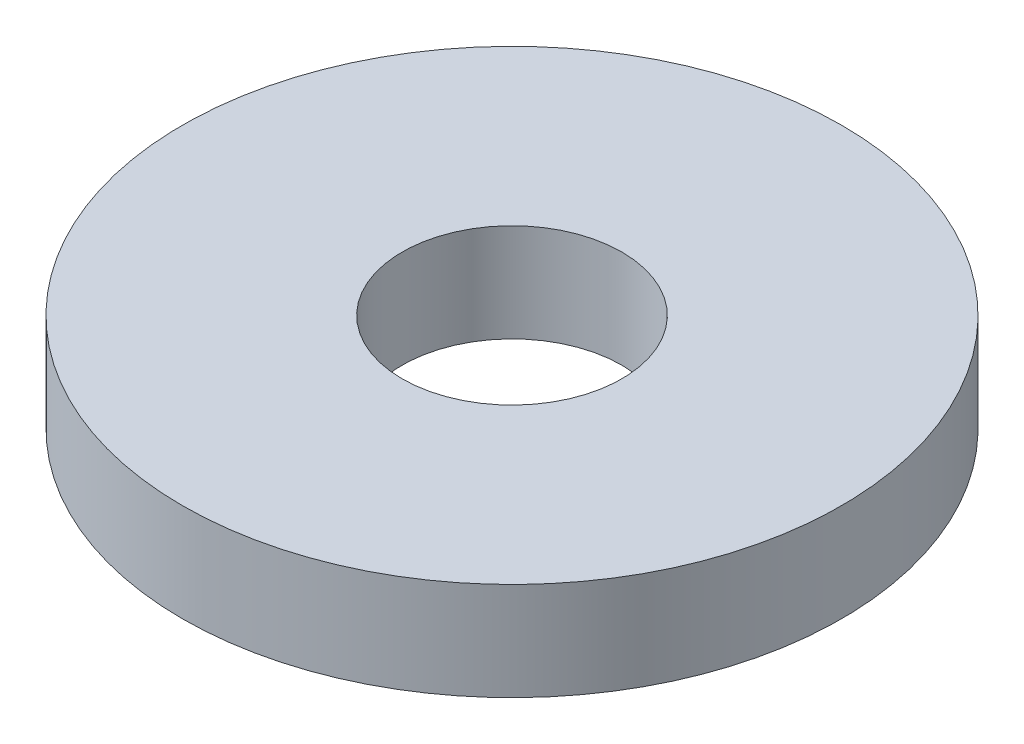
ISO-10303-21;
HEADER;
FILE_DESCRIPTION(('STEP AP214'),'2;1');
FILE_NAME('part.step','',(''),(''),'','','');
FILE_SCHEMA(('AUTOMOTIVE_DESIGN { 1 0 10303 214 1 1 1 1 }'));
ENDSEC;
DATA;
#1=APPLICATION_CONTEXT('core data for automotive mechanical design processes');
#2=APPLICATION_PROTOCOL_DEFINITION('international standard','automotive_design',2000,#1);
#3=PRODUCT_CONTEXT('',#1,'mechanical');
#4=PRODUCT('Part','Part','',(#3));
#5=PRODUCT_RELATED_PRODUCT_CATEGORY('part','',(#4));
#6=PRODUCT_DEFINITION_FORMATION('','',#4);
#7=PRODUCT_DEFINITION_CONTEXT('part definition',#1,'design');
#8=PRODUCT_DEFINITION('design','',#6,#7);
#9=PRODUCT_DEFINITION_SHAPE('','',#8);
#10=(LENGTH_UNIT() NAMED_UNIT(*) SI_UNIT(.MILLI.,.METRE.));
#11=(NAMED_UNIT(*) PLANE_ANGLE_UNIT() SI_UNIT($,.RADIAN.));
#12=(NAMED_UNIT(*) SI_UNIT($,.STERADIAN.) SOLID_ANGLE_UNIT());
#13=UNCERTAINTY_MEASURE_WITH_UNIT(LENGTH_MEASURE(1.E-05),#10,'distance_accuracy_value','');
#14=(GEOMETRIC_REPRESENTATION_CONTEXT(3) GLOBAL_UNCERTAINTY_ASSIGNED_CONTEXT((#13)) GLOBAL_UNIT_ASSIGNED_CONTEXT((#10,
#11,#12)) REPRESENTATION_CONTEXT('',''));
#15=CARTESIAN_POINT('',(0.,0.,0.));
#16=DIRECTION('',(0.,0.,1.));
#17=DIRECTION('',(1.,0.,0.));
#18=AXIS2_PLACEMENT_3D('',#15,#16,#17);
#19=CARTESIAN_POINT('',(0.,29.,0.));
#20=DIRECTION('',(0.,-1.,0.));
#21=DIRECTION('',(0.,0.,-1.));
#22=AXIS2_PLACEMENT_3D('',#19,#20,#21);
#23=CYLINDRICAL_SURFACE('',#22,97.5);
#24=CARTESIAN_POINT('',(0.,29.,0.));
#25=DIRECTION('',(0.,1.,0.));
#26=DIRECTION('',(0.,0.,1.));
#27=AXIS2_PLACEMENT_3D('',#24,#25,#26);
#28=CIRCLE('',#27,97.5);
#29=CARTESIAN_POINT('',(0.,29.,-97.5));
#30=VERTEX_POINT('',#29);
#31=EDGE_CURVE('E10',#30,#30,#28,.T.);
#32=CARTESIAN_POINT('',(0.,0.,0.));
#33=DIRECTION('',(0.,1.,0.));
#34=DIRECTION('',(0.,0.,1.));
#35=AXIS2_PLACEMENT_3D('',#32,#33,#34);
#36=CIRCLE('',#35,97.5);
#37=CARTESIAN_POINT('',(0.,0.,-97.5));
#38=VERTEX_POINT('',#37);
#39=EDGE_CURVE('E37',#38,#38,#36,.T.);
#40=CARTESIAN_POINT('',(0.,29.,-97.5));
#41=CARTESIAN_POINT('',(0.,28.6979166666667,-97.5));
#42=CARTESIAN_POINT('',(0.,28.3958333333333,-97.5));
#43=CARTESIAN_POINT('',(0.,27.7916666666667,-97.5));
#44=CARTESIAN_POINT('',(0.,27.4895833333333,-97.5));
#45=CARTESIAN_POINT('',(0.,26.8854166666667,-97.5));
#46=CARTESIAN_POINT('',(0.,26.5833333333333,-97.5));
#47=CARTESIAN_POINT('',(0.,25.9791666666667,-97.5));
#48=CARTESIAN_POINT('',(0.,25.6770833333333,-97.5));
#49=CARTESIAN_POINT('',(0.,25.0729166666667,-97.5));
#50=CARTESIAN_POINT('',(0.,24.7708333333333,-97.5));
#51=CARTESIAN_POINT('',(0.,24.1666666666667,-97.5));
#52=CARTESIAN_POINT('',(0.,23.8645833333333,-97.5));
#53=CARTESIAN_POINT('',(0.,23.2604166666667,-97.5));
#54=CARTESIAN_POINT('',(0.,22.9583333333333,-97.5));
#55=CARTESIAN_POINT('',(0.,22.3541666666667,-97.5));
#56=CARTESIAN_POINT('',(0.,22.0520833333333,-97.5));
#57=CARTESIAN_POINT('',(0.,21.4479166666667,-97.5));
#58=CARTESIAN_POINT('',(0.,21.1458333333333,-97.5));
#59=CARTESIAN_POINT('',(0.,20.5416666666667,-97.5));
#60=CARTESIAN_POINT('',(0.,20.2395833333333,-97.5));
#61=CARTESIAN_POINT('',(0.,19.6354166666667,-97.5));
#62=CARTESIAN_POINT('',(0.,19.3333333333333,-97.5));
#63=CARTESIAN_POINT('',(0.,18.7291666666667,-97.5));
#64=CARTESIAN_POINT('',(0.,18.4270833333333,-97.5));
#65=CARTESIAN_POINT('',(0.,17.8229166666667,-97.5));
#66=CARTESIAN_POINT('',(0.,17.5208333333333,-97.5));
#67=CARTESIAN_POINT('',(0.,16.9166666666667,-97.5));
#68=CARTESIAN_POINT('',(0.,16.6145833333333,-97.5));
#69=CARTESIAN_POINT('',(0.,16.0104166666667,-97.5));
#70=CARTESIAN_POINT('',(0.,15.7083333333333,-97.5));
#71=CARTESIAN_POINT('',(0.,15.1041666666667,-97.5));
#72=CARTESIAN_POINT('',(0.,14.8020833333333,-97.5));
#73=CARTESIAN_POINT('',(0.,14.1979166666667,-97.5));
#74=CARTESIAN_POINT('',(0.,13.8958333333333,-97.5));
#75=CARTESIAN_POINT('',(0.,13.2916666666667,-97.5));
#76=CARTESIAN_POINT('',(0.,12.9895833333333,-97.5));
#77=CARTESIAN_POINT('',(0.,12.3854166666667,-97.5));
#78=CARTESIAN_POINT('',(0.,12.0833333333333,-97.5));
#79=CARTESIAN_POINT('',(0.,11.4791666666667,-97.5));
#80=CARTESIAN_POINT('',(0.,11.1770833333333,-97.5));
#81=CARTESIAN_POINT('',(0.,10.5729166666667,-97.5));
#82=CARTESIAN_POINT('',(0.,10.2708333333333,-97.5));
#83=CARTESIAN_POINT('',(0.,9.66666666666667,-97.5));
#84=CARTESIAN_POINT('',(0.,9.36458333333333,-97.5));
#85=CARTESIAN_POINT('',(0.,8.76041666666667,-97.5));
#86=CARTESIAN_POINT('',(0.,8.45833333333333,-97.5));
#87=CARTESIAN_POINT('',(0.,7.85416666666667,-97.5));
#88=CARTESIAN_POINT('',(0.,7.55208333333333,-97.5));
#89=CARTESIAN_POINT('',(0.,6.94791666666667,-97.5));
#90=CARTESIAN_POINT('',(0.,6.64583333333333,-97.5));
#91=CARTESIAN_POINT('',(0.,6.04166666666667,-97.5));
#92=CARTESIAN_POINT('',(0.,5.73958333333333,-97.5));
#93=CARTESIAN_POINT('',(0.,5.13541666666667,-97.5));
#94=CARTESIAN_POINT('',(0.,4.83333333333333,-97.5));
#95=CARTESIAN_POINT('',(0.,4.22916666666667,-97.5));
#96=CARTESIAN_POINT('',(0.,3.92708333333333,-97.5));
#97=CARTESIAN_POINT('',(0.,3.32291666666667,-97.5));
#98=CARTESIAN_POINT('',(0.,3.02083333333333,-97.5));
#99=CARTESIAN_POINT('',(0.,2.41666666666667,-97.5));
#100=CARTESIAN_POINT('',(0.,2.11458333333333,-97.5));
#101=CARTESIAN_POINT('',(0.,1.51041666666667,-97.5));
#102=CARTESIAN_POINT('',(0.,1.20833333333333,-97.5));
#103=CARTESIAN_POINT('',(0.,0.604166666666667,-97.5));
#104=CARTESIAN_POINT('',(0.,0.302083333333333,-97.5));
#105=CARTESIAN_POINT('',(0.,0.,-97.5));
#106=B_SPLINE_CURVE_WITH_KNOTS('',3,(#40,#41,#42,#43,#44,#45,#46,#47,#48,#49,#50,#51,#52,#53,
#54,#55,#56,#57,#58,#59,#60,#61,#62,#63,#64,#65,#66,#67,#68,#69,#70,#71,#72,#73,#74,#75,#76,#77,
#78,#79,#80,#81,#82,#83,#84,#85,#86,#87,#88,#89,#90,#91,#92,#93,#94,#95,#96,#97,#98,#99,#100,
#101,#102,#103,#104,#105),.UNSPECIFIED.,.F.,.F.,(4,2,2,2,2,2,2,2,2,2,2,2,2,2,2,2,2,2,2,2,2,2,2,
2,2,2,2,2,2,2,2,2,4),(0.,0.906249999999997,1.8125,2.71875,3.625,4.53125,5.4375,6.34375,7.25,
8.15625,9.0625,9.96875,10.875,11.78125,12.6875,13.59375,14.5,15.40625,16.3125,17.21875,18.125,
19.03125,19.9375,20.84375,21.75,22.65625,23.5625,24.46875,25.375,26.28125,27.1875,28.09375,29.),.UNSPECIFIED.);
#107=EDGE_CURVE('BSEAM40',#30,#38,#106,.T.);
#108=ORIENTED_EDGE('',*,*,#31,.F.);
#109=ORIENTED_EDGE('',*,*,#39,.T.);
#110=ORIENTED_EDGE('',*,*,#107,.T.);
#111=ORIENTED_EDGE('',*,*,#107,.F.);
#112=EDGE_LOOP('',(#108,#110,#109,#111));
#113=FACE_BOUND('',#112,.T.);
#114=ADVANCED_FACE('F40',(#113),#23,.T.);
#115=CARTESIAN_POINT('',(0.,29.,0.));
#116=DIRECTION('',(0.,1.,0.));
#117=DIRECTION('',(0.,0.,1.));
#118=AXIS2_PLACEMENT_3D('',#115,#116,#117);
#119=PLANE('',#118);
#120=CARTESIAN_POINT('',(0.,29.,0.));
#121=DIRECTION('',(0.,1.,0.));
#122=DIRECTION('',(0.,0.,1.));
#123=AXIS2_PLACEMENT_3D('',#120,#121,#122);
#124=CIRCLE('',#123,32.5);
#125=CARTESIAN_POINT('',(0.,29.,-32.5));
#126=VERTEX_POINT('',#125);
#127=EDGE_CURVE('E50',#126,#126,#124,.T.);
#128=ORIENTED_EDGE('',*,*,#127,.F.);
#129=EDGE_LOOP('',(#128));
#130=FACE_BOUND('',#129,.T.);
#131=ORIENTED_EDGE('',*,*,#31,.T.);
#132=EDGE_LOOP('',(#131));
#133=FACE_BOUND('',#132,.T.);
#134=ADVANCED_FACE('F59',(#130,#133),#119,.T.);
#135=CARTESIAN_POINT('',(0.,0.,0.));
#136=DIRECTION('',(0.,1.,0.));
#137=DIRECTION('',(0.,0.,1.));
#138=AXIS2_PLACEMENT_3D('',#135,#136,#137);
#139=PLANE('',#138);
#140=CARTESIAN_POINT('',(0.,0.,0.));
#141=DIRECTION('',(0.,1.,0.));
#142=DIRECTION('',(0.,0.,1.));
#143=AXIS2_PLACEMENT_3D('',#140,#141,#142);
#144=CIRCLE('',#143,32.5);
#145=CARTESIAN_POINT('',(0.,0.,-32.5));
#146=VERTEX_POINT('',#145);
#147=EDGE_CURVE('E47',#146,#146,#144,.T.);
#148=ORIENTED_EDGE('',*,*,#147,.T.);
#149=EDGE_LOOP('',(#148));
#150=FACE_BOUND('',#149,.T.);
#151=ORIENTED_EDGE('',*,*,#39,.F.);
#152=EDGE_LOOP('',(#151));
#153=FACE_BOUND('',#152,.T.);
#154=ADVANCED_FACE('F58',(#150,#153),#139,.F.);
#155=CARTESIAN_POINT('',(0.,29.,0.));
#156=DIRECTION('',(0.,-1.,0.));
#157=DIRECTION('',(0.,0.,-1.));
#158=AXIS2_PLACEMENT_3D('',#155,#156,#157);
#159=CYLINDRICAL_SURFACE('',#158,32.5);
#160=CARTESIAN_POINT('',(0.,29.,-32.5));
#161=CARTESIAN_POINT('',(0.,28.6979166666667,-32.5));
#162=CARTESIAN_POINT('',(0.,28.3958333333333,-32.5));
#163=CARTESIAN_POINT('',(0.,27.7916666666667,-32.5));
#164=CARTESIAN_POINT('',(0.,27.4895833333333,-32.5));
#165=CARTESIAN_POINT('',(0.,26.8854166666667,-32.5));
#166=CARTESIAN_POINT('',(0.,26.5833333333333,-32.5));
#167=CARTESIAN_POINT('',(0.,25.9791666666667,-32.5));
#168=CARTESIAN_POINT('',(0.,25.6770833333333,-32.5));
#169=CARTESIAN_POINT('',(0.,25.0729166666667,-32.5));
#170=CARTESIAN_POINT('',(0.,24.7708333333333,-32.5));
#171=CARTESIAN_POINT('',(0.,24.1666666666667,-32.5));
#172=CARTESIAN_POINT('',(0.,23.8645833333333,-32.5));
#173=CARTESIAN_POINT('',(0.,23.2604166666667,-32.5));
#174=CARTESIAN_POINT('',(0.,22.9583333333333,-32.5));
#175=CARTESIAN_POINT('',(0.,22.3541666666667,-32.5));
#176=CARTESIAN_POINT('',(0.,22.0520833333333,-32.5));
#177=CARTESIAN_POINT('',(0.,21.4479166666667,-32.5));
#178=CARTESIAN_POINT('',(0.,21.1458333333333,-32.5));
#179=CARTESIAN_POINT('',(0.,20.5416666666667,-32.5));
#180=CARTESIAN_POINT('',(0.,20.2395833333333,-32.5));
#181=CARTESIAN_POINT('',(0.,19.6354166666667,-32.5));
#182=CARTESIAN_POINT('',(0.,19.3333333333333,-32.5));
#183=CARTESIAN_POINT('',(0.,18.7291666666667,-32.5));
#184=CARTESIAN_POINT('',(0.,18.4270833333333,-32.5));
#185=CARTESIAN_POINT('',(0.,17.8229166666667,-32.5));
#186=CARTESIAN_POINT('',(0.,17.5208333333333,-32.5));
#187=CARTESIAN_POINT('',(0.,16.9166666666667,-32.5));
#188=CARTESIAN_POINT('',(0.,16.6145833333333,-32.5));
#189=CARTESIAN_POINT('',(0.,16.0104166666667,-32.5));
#190=CARTESIAN_POINT('',(0.,15.7083333333333,-32.5));
#191=CARTESIAN_POINT('',(0.,15.1041666666667,-32.5));
#192=CARTESIAN_POINT('',(0.,14.8020833333333,-32.5));
#193=CARTESIAN_POINT('',(0.,14.1979166666667,-32.5));
#194=CARTESIAN_POINT('',(0.,13.8958333333333,-32.5));
#195=CARTESIAN_POINT('',(0.,13.2916666666667,-32.5));
#196=CARTESIAN_POINT('',(0.,12.9895833333333,-32.5));
#197=CARTESIAN_POINT('',(0.,12.3854166666667,-32.5));
#198=CARTESIAN_POINT('',(0.,12.0833333333333,-32.5));
#199=CARTESIAN_POINT('',(0.,11.4791666666667,-32.5));
#200=CARTESIAN_POINT('',(0.,11.1770833333333,-32.5));
#201=CARTESIAN_POINT('',(0.,10.5729166666667,-32.5));
#202=CARTESIAN_POINT('',(0.,10.2708333333333,-32.5));
#203=CARTESIAN_POINT('',(0.,9.66666666666667,-32.5));
#204=CARTESIAN_POINT('',(0.,9.36458333333333,-32.5));
#205=CARTESIAN_POINT('',(0.,8.76041666666667,-32.5));
#206=CARTESIAN_POINT('',(0.,8.45833333333333,-32.5));
#207=CARTESIAN_POINT('',(0.,7.85416666666667,-32.5));
#208=CARTESIAN_POINT('',(0.,7.55208333333333,-32.5));
#209=CARTESIAN_POINT('',(0.,6.94791666666667,-32.5));
#210=CARTESIAN_POINT('',(0.,6.64583333333333,-32.5));
#211=CARTESIAN_POINT('',(0.,6.04166666666667,-32.5));
#212=CARTESIAN_POINT('',(0.,5.73958333333333,-32.5));
#213=CARTESIAN_POINT('',(0.,5.13541666666667,-32.5));
#214=CARTESIAN_POINT('',(0.,4.83333333333333,-32.5));
#215=CARTESIAN_POINT('',(0.,4.22916666666667,-32.5));
#216=CARTESIAN_POINT('',(0.,3.92708333333333,-32.5));
#217=CARTESIAN_POINT('',(0.,3.32291666666667,-32.5));
#218=CARTESIAN_POINT('',(0.,3.02083333333333,-32.5));
#219=CARTESIAN_POINT('',(0.,2.41666666666667,-32.5));
#220=CARTESIAN_POINT('',(0.,2.11458333333333,-32.5));
#221=CARTESIAN_POINT('',(0.,1.51041666666667,-32.5));
#222=CARTESIAN_POINT('',(0.,1.20833333333333,-32.5));
#223=CARTESIAN_POINT('',(0.,0.604166666666667,-32.5));
#224=CARTESIAN_POINT('',(0.,0.302083333333333,-32.5));
#225=CARTESIAN_POINT('',(0.,0.,-32.5));
#226=B_SPLINE_CURVE_WITH_KNOTS('',3,(#160,#161,#162,#163,#164,#165,#166,#167,#168,#169,#170,
#171,#172,#173,#174,#175,#176,#177,#178,#179,#180,#181,#182,#183,#184,#185,#186,#187,#188,#189,
#190,#191,#192,#193,#194,#195,#196,#197,#198,#199,#200,#201,#202,#203,#204,#205,#206,#207,#208,
#209,#210,#211,#212,#213,#214,#215,#216,#217,#218,#219,#220,#221,#222,#223,#224,#225),
.UNSPECIFIED.,.F.,.F.,(4,2,2,2,2,2,2,2,2,2,2,2,2,2,2,2,2,2,2,2,2,2,2,2,2,2,2,2,2,2,2,2,4),(0.,
0.906249999999997,1.8125,2.71875,3.625,4.53125,5.4375,6.34375,7.25,8.15625,9.0625,9.96875,
10.875,11.78125,12.6875,13.59375,14.5,15.40625,16.3125,17.21875,18.125,19.03125,19.9375,
20.84375,21.75,22.65625,23.5625,24.46875,25.375,26.28125,27.1875,28.09375,29.),.UNSPECIFIED.);
#227=EDGE_CURVE('BSEAM54',#126,#146,#226,.T.);
#228=ORIENTED_EDGE('',*,*,#127,.T.);
#229=ORIENTED_EDGE('',*,*,#147,.F.);
#230=ORIENTED_EDGE('',*,*,#227,.T.);
#231=ORIENTED_EDGE('',*,*,#227,.F.);
#232=EDGE_LOOP('',(#228,#230,#229,#231));
#233=FACE_BOUND('',#232,.T.);
#234=ADVANCED_FACE('F54',(#233),#159,.F.);
#235=CLOSED_SHELL('',(#114,#134,#154,#234));
#236=MANIFOLD_SOLID_BREP('B2',#235);
#237=ADVANCED_BREP_SHAPE_REPRESENTATION('',(#18,#236),#14);
#238=SHAPE_DEFINITION_REPRESENTATION(#9,#237);
ENDSEC;
END-ISO-10303-21;
